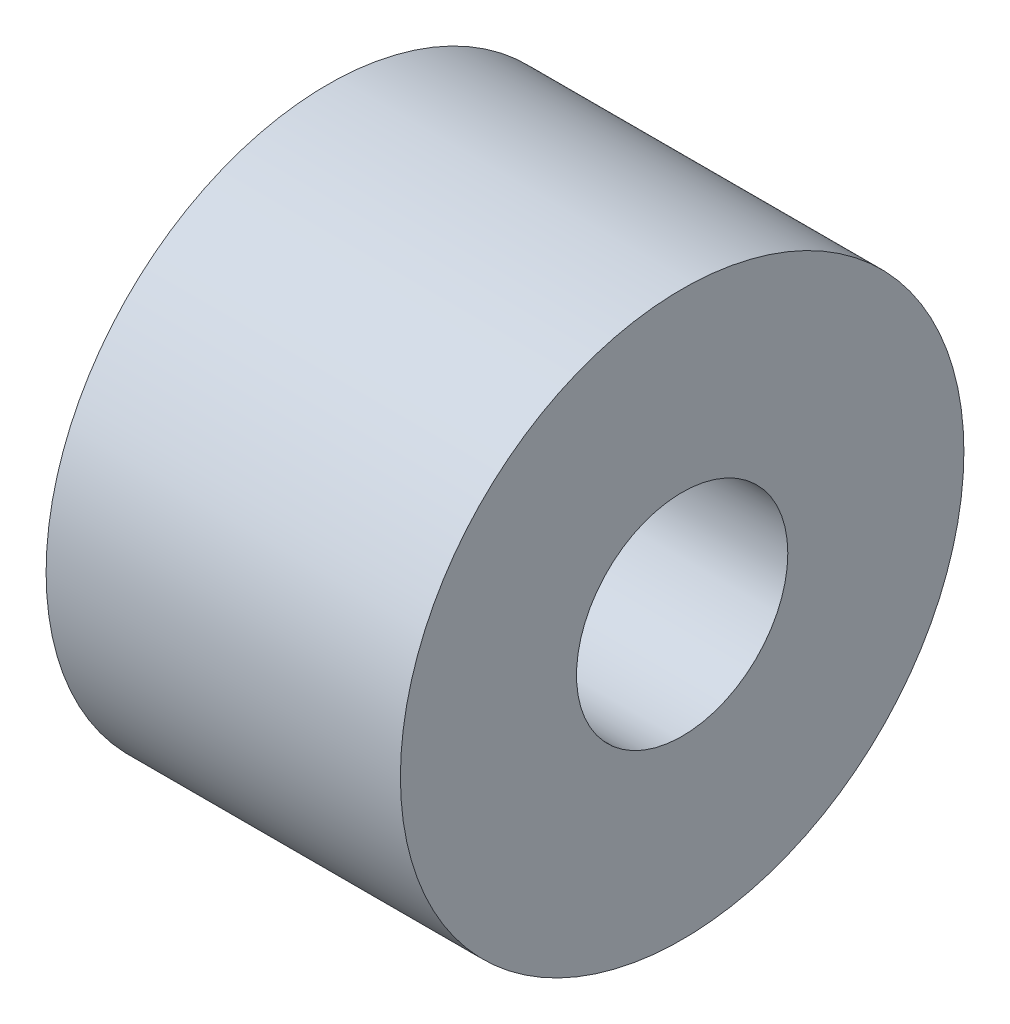
ISO-10303-21;
HEADER;
FILE_DESCRIPTION(('STEP AP214'),'2;1');
FILE_NAME('part.step','',(''),(''),'','','');
FILE_SCHEMA(('AUTOMOTIVE_DESIGN { 1 0 10303 214 1 1 1 1 }'));
ENDSEC;
DATA;
#1=APPLICATION_CONTEXT('core data for automotive mechanical design processes');
#2=APPLICATION_PROTOCOL_DEFINITION('international standard','automotive_design',2000,#1);
#3=PRODUCT_CONTEXT('',#1,'mechanical');
#4=PRODUCT('Part','Part','',(#3));
#5=PRODUCT_RELATED_PRODUCT_CATEGORY('part','',(#4));
#6=PRODUCT_DEFINITION_FORMATION('','',#4);
#7=PRODUCT_DEFINITION_CONTEXT('part definition',#1,'design');
#8=PRODUCT_DEFINITION('design','',#6,#7);
#9=PRODUCT_DEFINITION_SHAPE('','',#8);
#10=(LENGTH_UNIT() NAMED_UNIT(*) SI_UNIT(.MILLI.,.METRE.));
#11=(NAMED_UNIT(*) PLANE_ANGLE_UNIT() SI_UNIT($,.RADIAN.));
#12=(NAMED_UNIT(*) SI_UNIT($,.STERADIAN.) SOLID_ANGLE_UNIT());
#13=UNCERTAINTY_MEASURE_WITH_UNIT(LENGTH_MEASURE(1.E-05),#10,'distance_accuracy_value','');
#14=(GEOMETRIC_REPRESENTATION_CONTEXT(3) GLOBAL_UNCERTAINTY_ASSIGNED_CONTEXT((#13)) GLOBAL_UNIT_ASSIGNED_CONTEXT((#10,
#11,#12)) REPRESENTATION_CONTEXT('',''));
#15=CARTESIAN_POINT('',(0.,0.,0.));
#16=DIRECTION('',(0.,0.,1.));
#17=DIRECTION('',(1.,0.,0.));
#18=AXIS2_PLACEMENT_3D('',#15,#16,#17);
#19=CARTESIAN_POINT('',(2.515,0.,0.));
#20=DIRECTION('',(-1.,0.,0.));
#21=DIRECTION('',(0.,0.,1.));
#22=AXIS2_PLACEMENT_3D('',#19,#20,#21);
#23=CYLINDRICAL_SURFACE('',#22,4.);
#24=CARTESIAN_POINT('',(2.515,0.,0.));
#25=DIRECTION('',(1.,0.,0.));
#26=DIRECTION('',(0.,0.,-1.));
#27=AXIS2_PLACEMENT_3D('',#24,#25,#26);
#28=CIRCLE('',#27,4.);
#29=CARTESIAN_POINT('',(2.515,0.,-4.));
#30=VERTEX_POINT('',#29);
#31=EDGE_CURVE('E10',#30,#30,#28,.T.);
#32=ORIENTED_EDGE('',*,*,#31,.F.);
#33=EDGE_LOOP('',(#32));
#34=FACE_BOUND('',#33,.T.);
#35=CARTESIAN_POINT('',(-2.515,0.,0.));
#36=DIRECTION('',(1.,0.,0.));
#37=DIRECTION('',(0.,0.,-1.));
#38=AXIS2_PLACEMENT_3D('',#35,#36,#37);
#39=CIRCLE('',#38,4.);
#40=CARTESIAN_POINT('',(-2.515,0.,-4.00000000000006));
#41=VERTEX_POINT('',#40);
#42=EDGE_CURVE('E33',#41,#41,#39,.T.);
#43=ORIENTED_EDGE('',*,*,#42,.T.);
#44=EDGE_LOOP('',(#43));
#45=FACE_BOUND('',#44,.T.);
#46=ADVANCED_FACE('F30',(#34,#45),#23,.T.);
#47=CARTESIAN_POINT('',(2.515,0.,0.));
#48=DIRECTION('',(1.,0.,0.));
#49=DIRECTION('',(0.,0.,-1.));
#50=AXIS2_PLACEMENT_3D('',#47,#48,#49);
#51=PLANE('',#50);
#52=CARTESIAN_POINT('',(2.515,0.,0.));
#53=DIRECTION('',(1.,0.,0.));
#54=DIRECTION('',(0.,0.,-1.));
#55=AXIS2_PLACEMENT_3D('',#52,#53,#54);
#56=CIRCLE('',#55,1.5);
#57=CARTESIAN_POINT('',(2.515,0.,-1.5));
#58=VERTEX_POINT('',#57);
#59=EDGE_CURVE('E42',#58,#58,#56,.T.);
#60=ORIENTED_EDGE('',*,*,#59,.F.);
#61=EDGE_LOOP('',(#60));
#62=FACE_BOUND('',#61,.T.);
#63=ORIENTED_EDGE('',*,*,#31,.T.);
#64=EDGE_LOOP('',(#63));
#65=FACE_BOUND('',#64,.T.);
#66=ADVANCED_FACE('F57',(#62,#65),#51,.T.);
#67=CARTESIAN_POINT('',(-2.515,0.,0.));
#68=DIRECTION('',(1.,0.,0.));
#69=DIRECTION('',(0.,0.,-1.));
#70=AXIS2_PLACEMENT_3D('',#67,#68,#69);
#71=PLANE('',#70);
#72=CARTESIAN_POINT('',(-2.515,0.,0.));
#73=DIRECTION('',(1.,0.,0.));
#74=DIRECTION('',(0.,0.,-1.));
#75=AXIS2_PLACEMENT_3D('',#72,#73,#74);
#76=CIRCLE('',#75,1.5);
#77=CARTESIAN_POINT('',(-2.515,0.,-1.50000000000006));
#78=VERTEX_POINT('',#77);
#79=EDGE_CURVE('E40',#78,#78,#76,.T.);
#80=ORIENTED_EDGE('',*,*,#79,.T.);
#81=EDGE_LOOP('',(#80));
#82=FACE_BOUND('',#81,.T.);
#83=ORIENTED_EDGE('',*,*,#42,.F.);
#84=EDGE_LOOP('',(#83));
#85=FACE_BOUND('',#84,.T.);
#86=ADVANCED_FACE('F48',(#82,#85),#71,.F.);
#87=CARTESIAN_POINT('',(-2.515,0.,0.));
#88=DIRECTION('',(1.,0.,0.));
#89=DIRECTION('',(0.,0.,-1.));
#90=AXIS2_PLACEMENT_3D('',#87,#88,#89);
#91=CYLINDRICAL_SURFACE('',#90,1.5);
#92=ORIENTED_EDGE('',*,*,#79,.F.);
#93=EDGE_LOOP('',(#92));
#94=FACE_BOUND('',#93,.T.);
#95=ORIENTED_EDGE('',*,*,#59,.T.);
#96=EDGE_LOOP('',(#95));
#97=FACE_BOUND('',#96,.T.);
#98=ADVANCED_FACE('F51',(#94,#97),#91,.F.);
#99=CLOSED_SHELL('',(#46,#66,#86,#98));
#100=MANIFOLD_SOLID_BREP('B2',#99);
#101=ADVANCED_BREP_SHAPE_REPRESENTATION('',(#18,#100),#14);
#102=SHAPE_DEFINITION_REPRESENTATION(#9,#101);
ENDSEC;
END-ISO-10303-21;
